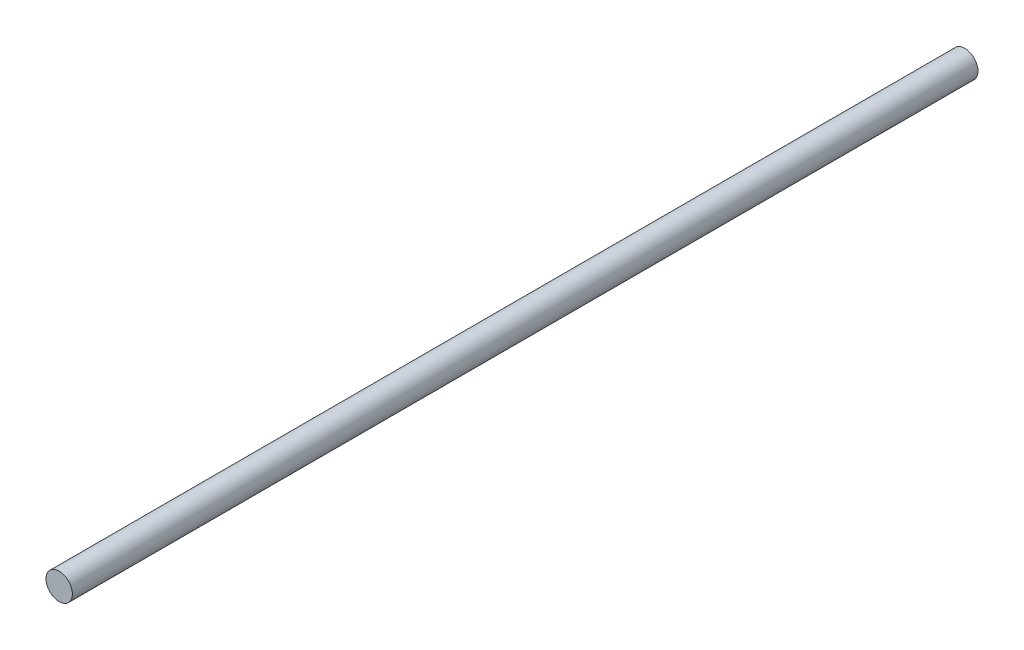
ISO-10303-21;
HEADER;
FILE_DESCRIPTION(('STEP AP214'),'2;1');
FILE_NAME('part.step','',(''),(''),'','','');
FILE_SCHEMA(('AUTOMOTIVE_DESIGN { 1 0 10303 214 1 1 1 1 }'));
ENDSEC;
DATA;
#1=APPLICATION_CONTEXT('core data for automotive mechanical design processes');
#2=APPLICATION_PROTOCOL_DEFINITION('international standard','automotive_design',2000,#1);
#3=PRODUCT_CONTEXT('',#1,'mechanical');
#4=PRODUCT('Part','Part','',(#3));
#5=PRODUCT_RELATED_PRODUCT_CATEGORY('part','',(#4));
#6=PRODUCT_DEFINITION_FORMATION('','',#4);
#7=PRODUCT_DEFINITION_CONTEXT('part definition',#1,'design');
#8=PRODUCT_DEFINITION('design','',#6,#7);
#9=PRODUCT_DEFINITION_SHAPE('','',#8);
#10=(LENGTH_UNIT() NAMED_UNIT(*) SI_UNIT(.MILLI.,.METRE.));
#11=(NAMED_UNIT(*) PLANE_ANGLE_UNIT() SI_UNIT($,.RADIAN.));
#12=(NAMED_UNIT(*) SI_UNIT($,.STERADIAN.) SOLID_ANGLE_UNIT());
#13=UNCERTAINTY_MEASURE_WITH_UNIT(LENGTH_MEASURE(1.E-05),#10,'distance_accuracy_value','');
#14=(GEOMETRIC_REPRESENTATION_CONTEXT(3) GLOBAL_UNCERTAINTY_ASSIGNED_CONTEXT((#13)) GLOBAL_UNIT_ASSIGNED_CONTEXT((#10,
#11,#12)) REPRESENTATION_CONTEXT('',''));
#15=CARTESIAN_POINT('',(0.,0.,0.));
#16=DIRECTION('',(0.,0.,1.));
#17=DIRECTION('',(1.,0.,0.));
#18=AXIS2_PLACEMENT_3D('',#15,#16,#17);
#19=CARTESIAN_POINT('',(0.,0.,168.));
#20=DIRECTION('',(0.,0.,-1.));
#21=DIRECTION('',(-1.,0.,0.));
#22=AXIS2_PLACEMENT_3D('',#19,#20,#21);
#23=CYLINDRICAL_SURFACE('',#22,2.45);
#24=CARTESIAN_POINT('',(0.,0.,168.));
#25=DIRECTION('',(0.,0.,1.));
#26=DIRECTION('',(1.,0.,0.));
#27=AXIS2_PLACEMENT_3D('',#24,#25,#26);
#28=CIRCLE('',#27,2.45);
#29=CARTESIAN_POINT('',(2.45,0.,168.));
#30=VERTEX_POINT('',#29);
#31=EDGE_CURVE('E10',#30,#30,#28,.T.);
#32=ORIENTED_EDGE('',*,*,#31,.F.);
#33=EDGE_LOOP('',(#32));
#34=FACE_BOUND('',#33,.T.);
#35=CARTESIAN_POINT('',(0.,0.,0.));
#36=DIRECTION('',(0.,0.,1.));
#37=DIRECTION('',(1.,0.,0.));
#38=AXIS2_PLACEMENT_3D('',#35,#36,#37);
#39=CIRCLE('',#38,2.45);
#40=CARTESIAN_POINT('',(2.45,0.,0.));
#41=VERTEX_POINT('',#40);
#42=EDGE_CURVE('E34',#41,#41,#39,.T.);
#43=ORIENTED_EDGE('',*,*,#42,.T.);
#44=EDGE_LOOP('',(#43));
#45=FACE_BOUND('',#44,.T.);
#46=ADVANCED_FACE('F31',(#34,#45),#23,.T.);
#47=CARTESIAN_POINT('',(0.,0.,168.));
#48=DIRECTION('',(0.,0.,1.));
#49=DIRECTION('',(1.,0.,0.));
#50=AXIS2_PLACEMENT_3D('',#47,#48,#49);
#51=PLANE('',#50);
#52=ORIENTED_EDGE('',*,*,#31,.T.);
#53=EDGE_LOOP('',(#52));
#54=FACE_BOUND('',#53,.T.);
#55=ADVANCED_FACE('F46',(#54),#51,.T.);
#56=CARTESIAN_POINT('',(0.,0.,0.));
#57=DIRECTION('',(0.,0.,1.));
#58=DIRECTION('',(1.,0.,0.));
#59=AXIS2_PLACEMENT_3D('',#56,#57,#58);
#60=PLANE('',#59);
#61=ORIENTED_EDGE('',*,*,#42,.F.);
#62=EDGE_LOOP('',(#61));
#63=FACE_BOUND('',#62,.T.);
#64=ADVANCED_FACE('F44',(#63),#60,.F.);
#65=CLOSED_SHELL('',(#46,#55,#64));
#66=MANIFOLD_SOLID_BREP('B2',#65);
#67=ADVANCED_BREP_SHAPE_REPRESENTATION('',(#18,#66),#14);
#68=SHAPE_DEFINITION_REPRESENTATION(#9,#67);
ENDSEC;
END-ISO-10303-21;
